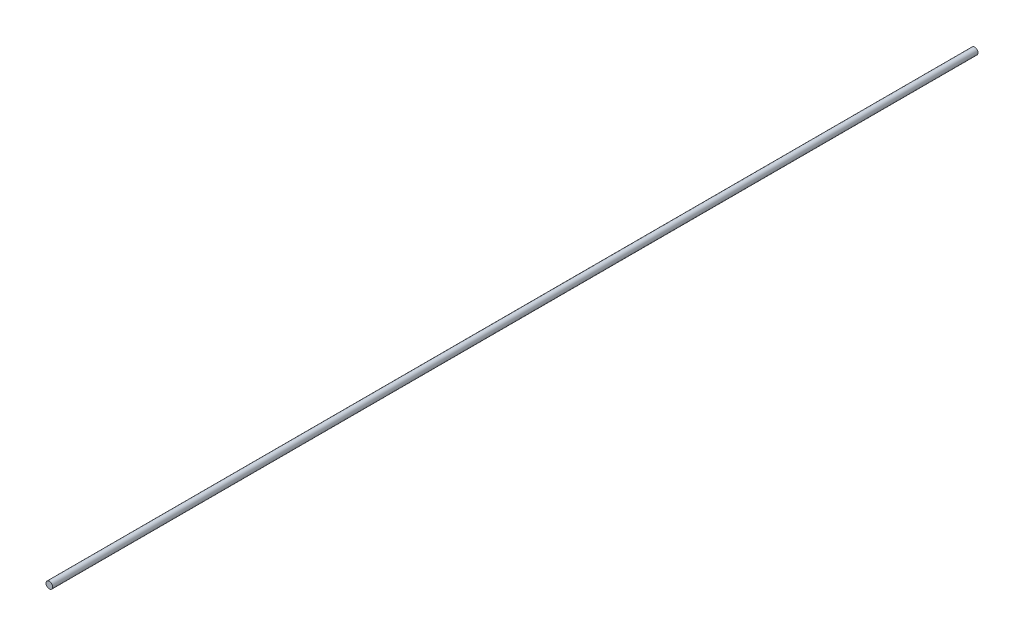
ISO-10303-21;
HEADER;
FILE_DESCRIPTION(('STEP AP214'),'2;1');
FILE_NAME('part.step','',(''),(''),'','','');
FILE_SCHEMA(('AUTOMOTIVE_DESIGN { 1 0 10303 214 1 1 1 1 }'));
ENDSEC;
DATA;
#1=APPLICATION_CONTEXT('core data for automotive mechanical design processes');
#2=APPLICATION_PROTOCOL_DEFINITION('international standard','automotive_design',2000,#1);
#3=PRODUCT_CONTEXT('',#1,'mechanical');
#4=PRODUCT('Part','Part','',(#3));
#5=PRODUCT_RELATED_PRODUCT_CATEGORY('part','',(#4));
#6=PRODUCT_DEFINITION_FORMATION('','',#4);
#7=PRODUCT_DEFINITION_CONTEXT('part definition',#1,'design');
#8=PRODUCT_DEFINITION('design','',#6,#7);
#9=PRODUCT_DEFINITION_SHAPE('','',#8);
#10=(LENGTH_UNIT() NAMED_UNIT(*) SI_UNIT(.MILLI.,.METRE.));
#11=(NAMED_UNIT(*) PLANE_ANGLE_UNIT() SI_UNIT($,.RADIAN.));
#12=(NAMED_UNIT(*) SI_UNIT($,.STERADIAN.) SOLID_ANGLE_UNIT());
#13=UNCERTAINTY_MEASURE_WITH_UNIT(LENGTH_MEASURE(1.E-05),#10,'distance_accuracy_value','');
#14=(GEOMETRIC_REPRESENTATION_CONTEXT(3) GLOBAL_UNCERTAINTY_ASSIGNED_CONTEXT((#13)) GLOBAL_UNIT_ASSIGNED_CONTEXT((#10,
#11,#12)) REPRESENTATION_CONTEXT('',''));
#15=CARTESIAN_POINT('',(0.,0.,0.));
#16=DIRECTION('',(0.,0.,1.));
#17=DIRECTION('',(1.,0.,0.));
#18=AXIS2_PLACEMENT_3D('',#15,#16,#17);
#19=CARTESIAN_POINT('',(0.,0.,319.));
#20=DIRECTION('',(0.,0.,-1.));
#21=DIRECTION('',(-1.,0.,0.));
#22=AXIS2_PLACEMENT_3D('',#19,#20,#21);
#23=CYLINDRICAL_SURFACE('',#22,1.15);
#24=CARTESIAN_POINT('',(0.,0.,319.));
#25=DIRECTION('',(0.,0.,1.));
#26=DIRECTION('',(1.,0.,0.));
#27=AXIS2_PLACEMENT_3D('',#24,#25,#26);
#28=CIRCLE('',#27,1.15);
#29=CARTESIAN_POINT('',(1.15,0.,319.));
#30=VERTEX_POINT('',#29);
#31=EDGE_CURVE('E10',#30,#30,#28,.T.);
#32=ORIENTED_EDGE('',*,*,#31,.F.);
#33=EDGE_LOOP('',(#32));
#34=FACE_BOUND('',#33,.T.);
#35=CARTESIAN_POINT('',(0.,0.,0.));
#36=DIRECTION('',(0.,0.,1.));
#37=DIRECTION('',(1.,0.,0.));
#38=AXIS2_PLACEMENT_3D('',#35,#36,#37);
#39=CIRCLE('',#38,1.15);
#40=CARTESIAN_POINT('',(1.15,0.,0.));
#41=VERTEX_POINT('',#40);
#42=EDGE_CURVE('E35',#41,#41,#39,.T.);
#43=ORIENTED_EDGE('',*,*,#42,.T.);
#44=EDGE_LOOP('',(#43));
#45=FACE_BOUND('',#44,.T.);
#46=ADVANCED_FACE('F32',(#34,#45),#23,.T.);
#47=CARTESIAN_POINT('',(0.,0.,319.));
#48=DIRECTION('',(0.,0.,1.));
#49=DIRECTION('',(1.,0.,0.));
#50=AXIS2_PLACEMENT_3D('',#47,#48,#49);
#51=PLANE('',#50);
#52=ORIENTED_EDGE('',*,*,#31,.T.);
#53=EDGE_LOOP('',(#52));
#54=FACE_BOUND('',#53,.T.);
#55=ADVANCED_FACE('F47',(#54),#51,.T.);
#56=CARTESIAN_POINT('',(0.,0.,0.));
#57=DIRECTION('',(0.,0.,1.));
#58=DIRECTION('',(1.,0.,0.));
#59=AXIS2_PLACEMENT_3D('',#56,#57,#58);
#60=PLANE('',#59);
#61=ORIENTED_EDGE('',*,*,#42,.F.);
#62=EDGE_LOOP('',(#61));
#63=FACE_BOUND('',#62,.T.);
#64=ADVANCED_FACE('F45',(#63),#60,.F.);
#65=CLOSED_SHELL('',(#46,#55,#64));
#66=MANIFOLD_SOLID_BREP('B2',#65);
#67=ADVANCED_BREP_SHAPE_REPRESENTATION('',(#18,#66),#14);
#68=SHAPE_DEFINITION_REPRESENTATION(#9,#67);
ENDSEC;
END-ISO-10303-21;
